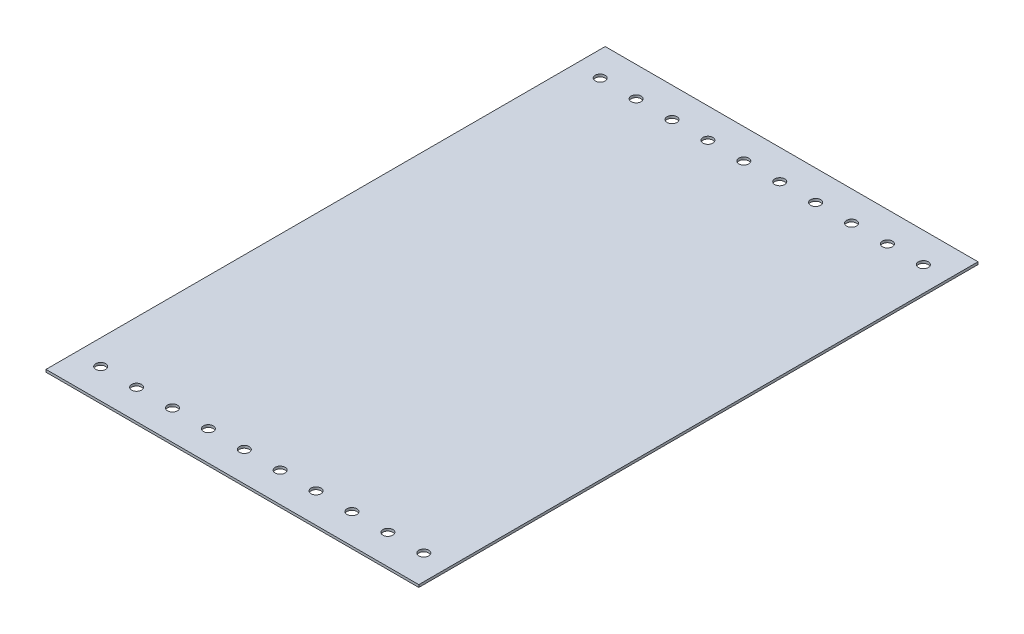
ISO-10303-21;
HEADER;
FILE_DESCRIPTION(('STEP AP214'),'2;1');
FILE_NAME('part.step','',(''),(''),'','','');
FILE_SCHEMA(('AUTOMOTIVE_DESIGN { 1 0 10303 214 1 1 1 1 }'));
ENDSEC;
DATA;
#1=APPLICATION_CONTEXT('core data for automotive mechanical design processes');
#2=APPLICATION_PROTOCOL_DEFINITION('international standard','automotive_design',2000,#1);
#3=PRODUCT_CONTEXT('',#1,'mechanical');
#4=PRODUCT('Part','Part','',(#3));
#5=PRODUCT_RELATED_PRODUCT_CATEGORY('part','',(#4));
#6=PRODUCT_DEFINITION_FORMATION('','',#4);
#7=PRODUCT_DEFINITION_CONTEXT('part definition',#1,'design');
#8=PRODUCT_DEFINITION('design','',#6,#7);
#9=PRODUCT_DEFINITION_SHAPE('','',#8);
#10=(LENGTH_UNIT() NAMED_UNIT(*) SI_UNIT(.MILLI.,.METRE.));
#11=(NAMED_UNIT(*) PLANE_ANGLE_UNIT() SI_UNIT($,.RADIAN.));
#12=(NAMED_UNIT(*) SI_UNIT($,.STERADIAN.) SOLID_ANGLE_UNIT());
#13=UNCERTAINTY_MEASURE_WITH_UNIT(LENGTH_MEASURE(1.E-05),#10,'distance_accuracy_value','');
#14=(GEOMETRIC_REPRESENTATION_CONTEXT(3) GLOBAL_UNCERTAINTY_ASSIGNED_CONTEXT((#13)) GLOBAL_UNIT_ASSIGNED_CONTEXT((#10,
#11,#12)) REPRESENTATION_CONTEXT('',''));
#15=CARTESIAN_POINT('',(0.,0.,0.));
#16=DIRECTION('',(0.,0.,1.));
#17=DIRECTION('',(1.,0.,0.));
#18=AXIS2_PLACEMENT_3D('',#15,#16,#17);
#19=CARTESIAN_POINT('',(-150.,2.,225.));
#20=DIRECTION('',(1.,0.,0.));
#21=DIRECTION('',(0.,0.,-1.));
#22=AXIS2_PLACEMENT_3D('',#19,#20,#21);
#23=PLANE('',#22);
#24=DIRECTION('',(0.,0.,1.));
#25=VECTOR('',#24,1.);
#26=CARTESIAN_POINT('',(-150.,0.,225.));
#27=LINE('',#26,#25);
#28=CARTESIAN_POINT('',(-150.,0.,-225.));
#29=VERTEX_POINT('',#28);
#30=CARTESIAN_POINT('',(-150.,0.,225.));
#31=VERTEX_POINT('',#30);
#32=EDGE_CURVE('E96',#29,#31,#27,.T.);
#33=ORIENTED_EDGE('',*,*,#32,.T.);
#34=DIRECTION('',(0.,-1.,0.));
#35=VECTOR('',#34,1.);
#36=CARTESIAN_POINT('',(-150.,2.,225.));
#37=LINE('',#36,#35);
#38=CARTESIAN_POINT('',(-150.,2.,225.));
#39=VERTEX_POINT('',#38);
#40=EDGE_CURVE('E11',#39,#31,#37,.T.);
#41=ORIENTED_EDGE('',*,*,#40,.F.);
#42=DIRECTION('',(0.,0.,1.));
#43=VECTOR('',#42,1.);
#44=CARTESIAN_POINT('',(-150.,2.,225.));
#45=LINE('',#44,#43);
#46=CARTESIAN_POINT('',(-150.,2.,-225.));
#47=VERTEX_POINT('',#46);
#48=EDGE_CURVE('E84',#47,#39,#45,.T.);
#49=ORIENTED_EDGE('',*,*,#48,.F.);
#50=DIRECTION('',(0.,-1.,0.));
#51=VECTOR('',#50,1.);
#52=CARTESIAN_POINT('',(-150.,2.,-225.));
#53=LINE('',#52,#51);
#54=EDGE_CURVE('E92',#47,#29,#53,.T.);
#55=ORIENTED_EDGE('',*,*,#54,.T.);
#56=EDGE_LOOP('',(#33,#41,#49,#55));
#57=FACE_BOUND('',#56,.T.);
#58=ADVANCED_FACE('F33',(#57),#23,.F.);
#59=CARTESIAN_POINT('',(150.,2.,225.));
#60=DIRECTION('',(0.,0.,-1.));
#61=DIRECTION('',(-1.,0.,0.));
#62=AXIS2_PLACEMENT_3D('',#59,#60,#61);
#63=PLANE('',#62);
#64=DIRECTION('',(1.,0.,0.));
#65=VECTOR('',#64,1.);
#66=CARTESIAN_POINT('',(150.,0.,225.));
#67=LINE('',#66,#65);
#68=CARTESIAN_POINT('',(150.,0.,225.));
#69=VERTEX_POINT('',#68);
#70=EDGE_CURVE('E88',#31,#69,#67,.T.);
#71=ORIENTED_EDGE('',*,*,#70,.T.);
#72=DIRECTION('',(0.,-1.,0.));
#73=VECTOR('',#72,1.);
#74=CARTESIAN_POINT('',(150.,2.,225.));
#75=LINE('',#74,#73);
#76=CARTESIAN_POINT('',(150.,2.,225.));
#77=VERTEX_POINT('',#76);
#78=EDGE_CURVE('E41',#77,#69,#75,.T.);
#79=ORIENTED_EDGE('',*,*,#78,.F.);
#80=DIRECTION('',(1.,0.,0.));
#81=VECTOR('',#80,1.);
#82=CARTESIAN_POINT('',(150.,2.,225.));
#83=LINE('',#82,#81);
#84=EDGE_CURVE('E79',#39,#77,#83,.T.);
#85=ORIENTED_EDGE('',*,*,#84,.F.);
#86=ORIENTED_EDGE('',*,*,#40,.T.);
#87=EDGE_LOOP('',(#71,#79,#85,#86));
#88=FACE_BOUND('',#87,.T.);
#89=ADVANCED_FACE('F87',(#88),#63,.F.);
#90=CARTESIAN_POINT('',(150.,2.,225.));
#91=DIRECTION('',(-1.,0.,0.));
#92=DIRECTION('',(0.,0.,1.));
#93=AXIS2_PLACEMENT_3D('',#90,#91,#92);
#94=PLANE('',#93);
#95=DIRECTION('',(0.,0.,-1.));
#96=VECTOR('',#95,1.);
#97=CARTESIAN_POINT('',(150.,0.,225.));
#98=LINE('',#97,#96);
#99=CARTESIAN_POINT('',(150.,0.,-225.));
#100=VERTEX_POINT('',#99);
#101=EDGE_CURVE('E66',#69,#100,#98,.T.);
#102=ORIENTED_EDGE('',*,*,#101,.T.);
#103=DIRECTION('',(0.,-1.,0.));
#104=VECTOR('',#103,1.);
#105=CARTESIAN_POINT('',(150.,2.,-225.));
#106=LINE('',#105,#104);
#107=CARTESIAN_POINT('',(150.,2.,-225.));
#108=VERTEX_POINT('',#107);
#109=EDGE_CURVE('E89',#108,#100,#106,.T.);
#110=ORIENTED_EDGE('',*,*,#109,.F.);
#111=DIRECTION('',(0.,0.,-1.));
#112=VECTOR('',#111,1.);
#113=CARTESIAN_POINT('',(150.,2.,225.));
#114=LINE('',#113,#112);
#115=EDGE_CURVE('E82',#77,#108,#114,.T.);
#116=ORIENTED_EDGE('',*,*,#115,.F.);
#117=ORIENTED_EDGE('',*,*,#78,.T.);
#118=EDGE_LOOP('',(#102,#110,#116,#117));
#119=FACE_BOUND('',#118,.T.);
#120=ADVANCED_FACE('F90',(#119),#94,.F.);
#121=CARTESIAN_POINT('',(150.,2.,-225.));
#122=DIRECTION('',(0.,0.,1.));
#123=DIRECTION('',(1.,0.,0.));
#124=AXIS2_PLACEMENT_3D('',#121,#122,#123);
#125=PLANE('',#124);
#126=DIRECTION('',(-1.,0.,0.));
#127=VECTOR('',#126,1.);
#128=CARTESIAN_POINT('',(150.,0.,-225.));
#129=LINE('',#128,#127);
#130=EDGE_CURVE('E72',#100,#29,#129,.T.);
#131=ORIENTED_EDGE('',*,*,#130,.T.);
#132=ORIENTED_EDGE('',*,*,#54,.F.);
#133=DIRECTION('',(-1.,0.,0.));
#134=VECTOR('',#133,1.);
#135=CARTESIAN_POINT('',(150.,2.,-225.));
#136=LINE('',#135,#134);
#137=EDGE_CURVE('E49',#108,#47,#136,.T.);
#138=ORIENTED_EDGE('',*,*,#137,.F.);
#139=ORIENTED_EDGE('',*,*,#109,.T.);
#140=EDGE_LOOP('',(#131,#132,#138,#139));
#141=FACE_BOUND('',#140,.T.);
#142=ADVANCED_FACE('F104',(#141),#125,.F.);
#143=CARTESIAN_POINT('',(0.,2.,0.));
#144=DIRECTION('',(0.,1.,0.));
#145=DIRECTION('',(0.,0.,1.));
#146=AXIS2_PLACEMENT_3D('',#143,#144,#145);
#147=PLANE('',#146);
#148=CARTESIAN_POINT('',(-43.3333333333332,2.,201.));
#149=DIRECTION('',(0.,1.,0.));
#150=DIRECTION('',(0.,0.,-1.));
#151=AXIS2_PLACEMENT_3D('',#148,#149,#150);
#152=CIRCLE('',#151,3.99999999999999);
#153=CARTESIAN_POINT('',(-43.3333333333332,2.,197.));
#154=VERTEX_POINT('',#153);
#155=EDGE_CURVE('E164',#154,#154,#152,.T.);
#156=ORIENTED_EDGE('',*,*,#155,.F.);
#157=EDGE_LOOP('',(#156));
#158=FACE_BOUND('',#157,.T.);
#159=CARTESIAN_POINT('',(-14.4444444444444,2.,201.));
#160=DIRECTION('',(0.,1.,0.));
#161=DIRECTION('',(0.,0.,-1.));
#162=AXIS2_PLACEMENT_3D('',#159,#160,#161);
#163=CIRCLE('',#162,3.99999999999999);
#164=CARTESIAN_POINT('',(-14.4444444444444,2.,197.));
#165=VERTEX_POINT('',#164);
#166=EDGE_CURVE('E171',#165,#165,#163,.T.);
#167=ORIENTED_EDGE('',*,*,#166,.F.);
#168=EDGE_LOOP('',(#167));
#169=FACE_BOUND('',#168,.T.);
#170=CARTESIAN_POINT('',(14.4444444444445,2.,201.));
#171=DIRECTION('',(0.,1.,0.));
#172=DIRECTION('',(0.,0.,-1.));
#173=AXIS2_PLACEMENT_3D('',#170,#171,#172);
#174=CIRCLE('',#173,3.99999999999999);
#175=CARTESIAN_POINT('',(14.4444444444445,2.,197.));
#176=VERTEX_POINT('',#175);
#177=EDGE_CURVE('E177',#176,#176,#174,.T.);
#178=ORIENTED_EDGE('',*,*,#177,.F.);
#179=EDGE_LOOP('',(#178));
#180=FACE_BOUND('',#179,.T.);
#181=CARTESIAN_POINT('',(43.3333333333334,2.,201.));
#182=DIRECTION('',(0.,1.,0.));
#183=DIRECTION('',(0.,0.,-1.));
#184=AXIS2_PLACEMENT_3D('',#181,#182,#183);
#185=CIRCLE('',#184,3.99999999999999);
#186=CARTESIAN_POINT('',(43.3333333333334,2.,197.));
#187=VERTEX_POINT('',#186);
#188=EDGE_CURVE('E183',#187,#187,#185,.T.);
#189=ORIENTED_EDGE('',*,*,#188,.F.);
#190=EDGE_LOOP('',(#189));
#191=FACE_BOUND('',#190,.T.);
#192=CARTESIAN_POINT('',(72.2222222222223,2.,201.));
#193=DIRECTION('',(0.,1.,0.));
#194=DIRECTION('',(0.,0.,-1.));
#195=AXIS2_PLACEMENT_3D('',#192,#193,#194);
#196=CIRCLE('',#195,3.99999999999998);
#197=CARTESIAN_POINT('',(72.2222222222223,2.,197.));
#198=VERTEX_POINT('',#197);
#199=EDGE_CURVE('E189',#198,#198,#196,.T.);
#200=ORIENTED_EDGE('',*,*,#199,.F.);
#201=EDGE_LOOP('',(#200));
#202=FACE_BOUND('',#201,.T.);
#203=CARTESIAN_POINT('',(101.111111111111,2.,201.));
#204=DIRECTION('',(0.,1.,0.));
#205=DIRECTION('',(0.,0.,-1.));
#206=AXIS2_PLACEMENT_3D('',#203,#204,#205);
#207=CIRCLE('',#206,3.99999999999999);
#208=CARTESIAN_POINT('',(101.111111111111,2.,197.));
#209=VERTEX_POINT('',#208);
#210=EDGE_CURVE('E195',#209,#209,#207,.T.);
#211=ORIENTED_EDGE('',*,*,#210,.F.);
#212=EDGE_LOOP('',(#211));
#213=FACE_BOUND('',#212,.T.);
#214=CARTESIAN_POINT('',(130.,2.,201.));
#215=DIRECTION('',(0.,1.,0.));
#216=DIRECTION('',(0.,0.,-1.));
#217=AXIS2_PLACEMENT_3D('',#214,#215,#216);
#218=CIRCLE('',#217,3.99999999999999);
#219=CARTESIAN_POINT('',(130.,2.,197.));
#220=VERTEX_POINT('',#219);
#221=EDGE_CURVE('E201',#220,#220,#218,.T.);
#222=ORIENTED_EDGE('',*,*,#221,.F.);
#223=EDGE_LOOP('',(#222));
#224=FACE_BOUND('',#223,.T.);
#225=CARTESIAN_POINT('',(130.,2.,-201.));
#226=DIRECTION('',(0.,1.,0.));
#227=DIRECTION('',(0.,0.,1.));
#228=AXIS2_PLACEMENT_3D('',#225,#226,#227);
#229=CIRCLE('',#228,3.99999999999999);
#230=CARTESIAN_POINT('',(130.,2.,-197.));
#231=VERTEX_POINT('',#230);
#232=EDGE_CURVE('E207',#231,#231,#229,.T.);
#233=ORIENTED_EDGE('',*,*,#232,.F.);
#234=EDGE_LOOP('',(#233));
#235=FACE_BOUND('',#234,.T.);
#236=CARTESIAN_POINT('',(101.111111111111,2.,-201.));
#237=DIRECTION('',(0.,1.,0.));
#238=DIRECTION('',(0.,0.,1.));
#239=AXIS2_PLACEMENT_3D('',#236,#237,#238);
#240=CIRCLE('',#239,3.99999999999999);
#241=CARTESIAN_POINT('',(101.111111111111,2.,-197.));
#242=VERTEX_POINT('',#241);
#243=EDGE_CURVE('E116',#242,#242,#240,.T.);
#244=ORIENTED_EDGE('',*,*,#243,.F.);
#245=EDGE_LOOP('',(#244));
#246=FACE_BOUND('',#245,.T.);
#247=CARTESIAN_POINT('',(72.2222222222222,2.,-201.));
#248=DIRECTION('',(0.,1.,0.));
#249=DIRECTION('',(0.,0.,1.));
#250=AXIS2_PLACEMENT_3D('',#247,#248,#249);
#251=CIRCLE('',#250,3.99999999999999);
#252=CARTESIAN_POINT('',(72.2222222222222,2.,-197.));
#253=VERTEX_POINT('',#252);
#254=EDGE_CURVE('E123',#253,#253,#251,.T.);
#255=ORIENTED_EDGE('',*,*,#254,.F.);
#256=EDGE_LOOP('',(#255));
#257=FACE_BOUND('',#256,.T.);
#258=CARTESIAN_POINT('',(43.3333333333333,2.,-201.));
#259=DIRECTION('',(0.,1.,0.));
#260=DIRECTION('',(0.,0.,1.));
#261=AXIS2_PLACEMENT_3D('',#258,#259,#260);
#262=CIRCLE('',#261,3.99999999999999);
#263=CARTESIAN_POINT('',(43.3333333333333,2.,-197.));
#264=VERTEX_POINT('',#263);
#265=EDGE_CURVE('E129',#264,#264,#262,.T.);
#266=ORIENTED_EDGE('',*,*,#265,.F.);
#267=EDGE_LOOP('',(#266));
#268=FACE_BOUND('',#267,.T.);
#269=CARTESIAN_POINT('',(14.4444444444445,2.,-201.));
#270=DIRECTION('',(0.,1.,0.));
#271=DIRECTION('',(0.,0.,1.));
#272=AXIS2_PLACEMENT_3D('',#269,#270,#271);
#273=CIRCLE('',#272,3.99999999999999);
#274=CARTESIAN_POINT('',(14.4444444444445,2.,-197.));
#275=VERTEX_POINT('',#274);
#276=EDGE_CURVE('E135',#275,#275,#273,.T.);
#277=ORIENTED_EDGE('',*,*,#276,.F.);
#278=EDGE_LOOP('',(#277));
#279=FACE_BOUND('',#278,.T.);
#280=CARTESIAN_POINT('',(-14.4444444444444,2.,-201.));
#281=DIRECTION('',(0.,1.,0.));
#282=DIRECTION('',(0.,0.,1.));
#283=AXIS2_PLACEMENT_3D('',#280,#281,#282);
#284=CIRCLE('',#283,3.99999999999999);
#285=CARTESIAN_POINT('',(-14.4444444444444,2.,-197.));
#286=VERTEX_POINT('',#285);
#287=EDGE_CURVE('E141',#286,#286,#284,.T.);
#288=ORIENTED_EDGE('',*,*,#287,.F.);
#289=EDGE_LOOP('',(#288));
#290=FACE_BOUND('',#289,.T.);
#291=CARTESIAN_POINT('',(-43.3333333333333,2.,-201.));
#292=DIRECTION('',(0.,1.,0.));
#293=DIRECTION('',(0.,0.,1.));
#294=AXIS2_PLACEMENT_3D('',#291,#292,#293);
#295=CIRCLE('',#294,3.99999999999999);
#296=CARTESIAN_POINT('',(-43.3333333333333,2.,-197.));
#297=VERTEX_POINT('',#296);
#298=EDGE_CURVE('E147',#297,#297,#295,.T.);
#299=ORIENTED_EDGE('',*,*,#298,.F.);
#300=EDGE_LOOP('',(#299));
#301=FACE_BOUND('',#300,.T.);
#302=CARTESIAN_POINT('',(-72.2222222222222,2.,-201.));
#303=DIRECTION('',(0.,1.,0.));
#304=DIRECTION('',(0.,0.,1.));
#305=AXIS2_PLACEMENT_3D('',#302,#303,#304);
#306=CIRCLE('',#305,3.99999999999999);
#307=CARTESIAN_POINT('',(-72.2222222222222,2.,-197.));
#308=VERTEX_POINT('',#307);
#309=EDGE_CURVE('E153',#308,#308,#306,.T.);
#310=ORIENTED_EDGE('',*,*,#309,.F.);
#311=EDGE_LOOP('',(#310));
#312=FACE_BOUND('',#311,.T.);
#313=CARTESIAN_POINT('',(-101.111111111111,2.,-201.));
#314=DIRECTION('',(0.,1.,0.));
#315=DIRECTION('',(0.,0.,1.));
#316=AXIS2_PLACEMENT_3D('',#313,#314,#315);
#317=CIRCLE('',#316,3.99999999999999);
#318=CARTESIAN_POINT('',(-101.111111111111,2.,-197.));
#319=VERTEX_POINT('',#318);
#320=EDGE_CURVE('E159',#319,#319,#317,.T.);
#321=ORIENTED_EDGE('',*,*,#320,.F.);
#322=EDGE_LOOP('',(#321));
#323=FACE_BOUND('',#322,.T.);
#324=CARTESIAN_POINT('',(-72.2222222222221,2.,201.));
#325=DIRECTION('',(0.,1.,0.));
#326=DIRECTION('',(0.,0.,-1.));
#327=AXIS2_PLACEMENT_3D('',#324,#325,#326);
#328=CIRCLE('',#327,3.99999999999999);
#329=CARTESIAN_POINT('',(-72.2222222222221,2.,197.));
#330=VERTEX_POINT('',#329);
#331=EDGE_CURVE('E224',#330,#330,#328,.T.);
#332=ORIENTED_EDGE('',*,*,#331,.F.);
#333=EDGE_LOOP('',(#332));
#334=FACE_BOUND('',#333,.T.);
#335=CARTESIAN_POINT('',(-101.111111111111,2.,201.));
#336=DIRECTION('',(0.,1.,0.));
#337=DIRECTION('',(0.,0.,-1.));
#338=AXIS2_PLACEMENT_3D('',#335,#336,#337);
#339=CIRCLE('',#338,3.99999999999999);
#340=CARTESIAN_POINT('',(-101.111111111111,2.,197.));
#341=VERTEX_POINT('',#340);
#342=EDGE_CURVE('E218',#341,#341,#339,.T.);
#343=ORIENTED_EDGE('',*,*,#342,.F.);
#344=EDGE_LOOP('',(#343));
#345=FACE_BOUND('',#344,.T.);
#346=CARTESIAN_POINT('',(-130.,2.,201.));
#347=DIRECTION('',(0.,1.,0.));
#348=DIRECTION('',(0.,0.,-1.));
#349=AXIS2_PLACEMENT_3D('',#346,#347,#348);
#350=CIRCLE('',#349,3.99999999999999);
#351=CARTESIAN_POINT('',(-130.,2.,197.));
#352=VERTEX_POINT('',#351);
#353=EDGE_CURVE('E212',#352,#352,#350,.T.);
#354=ORIENTED_EDGE('',*,*,#353,.F.);
#355=EDGE_LOOP('',(#354));
#356=FACE_BOUND('',#355,.T.);
#357=CARTESIAN_POINT('',(-130.,2.,-201.));
#358=DIRECTION('',(0.,1.,0.));
#359=DIRECTION('',(0.,0.,1.));
#360=AXIS2_PLACEMENT_3D('',#357,#358,#359);
#361=CIRCLE('',#360,3.99999999999999);
#362=CARTESIAN_POINT('',(-130.,2.,-197.));
#363=VERTEX_POINT('',#362);
#364=EDGE_CURVE('E110',#363,#363,#361,.T.);
#365=ORIENTED_EDGE('',*,*,#364,.F.);
#366=EDGE_LOOP('',(#365));
#367=FACE_BOUND('',#366,.T.);
#368=ORIENTED_EDGE('',*,*,#48,.T.);
#369=ORIENTED_EDGE('',*,*,#84,.T.);
#370=ORIENTED_EDGE('',*,*,#115,.T.);
#371=ORIENTED_EDGE('',*,*,#137,.T.);
#372=EDGE_LOOP('',(#368,#369,#370,#371));
#373=FACE_BOUND('',#372,.T.);
#374=ADVANCED_FACE('F80',(#158,#169,#180,#191,#202,#213,#224,#235,#246,#257,#268,#279,#290,#301,
#312,#323,#334,#345,#356,#367,#373),#147,.T.);
#375=CARTESIAN_POINT('',(0.,0.,0.));
#376=DIRECTION('',(0.,1.,0.));
#377=DIRECTION('',(0.,0.,1.));
#378=AXIS2_PLACEMENT_3D('',#375,#376,#377);
#379=PLANE('',#378);
#380=CARTESIAN_POINT('',(-43.3333333333332,0.,201.));
#381=DIRECTION('',(0.,1.,0.));
#382=DIRECTION('',(0.,0.,-1.));
#383=AXIS2_PLACEMENT_3D('',#380,#381,#382);
#384=CIRCLE('',#383,3.99999999999999);
#385=CARTESIAN_POINT('',(-43.3333333333332,0.,197.));
#386=VERTEX_POINT('',#385);
#387=EDGE_CURVE('E167',#386,#386,#384,.T.);
#388=ORIENTED_EDGE('',*,*,#387,.T.);
#389=EDGE_LOOP('',(#388));
#390=FACE_BOUND('',#389,.T.);
#391=CARTESIAN_POINT('',(-14.4444444444444,0.,201.));
#392=DIRECTION('',(0.,1.,0.));
#393=DIRECTION('',(0.,0.,-1.));
#394=AXIS2_PLACEMENT_3D('',#391,#392,#393);
#395=CIRCLE('',#394,3.99999999999999);
#396=CARTESIAN_POINT('',(-14.4444444444444,0.,197.));
#397=VERTEX_POINT('',#396);
#398=EDGE_CURVE('E174',#397,#397,#395,.T.);
#399=ORIENTED_EDGE('',*,*,#398,.T.);
#400=EDGE_LOOP('',(#399));
#401=FACE_BOUND('',#400,.T.);
#402=CARTESIAN_POINT('',(14.4444444444445,0.,201.));
#403=DIRECTION('',(0.,1.,0.));
#404=DIRECTION('',(0.,0.,-1.));
#405=AXIS2_PLACEMENT_3D('',#402,#403,#404);
#406=CIRCLE('',#405,3.99999999999999);
#407=CARTESIAN_POINT('',(14.4444444444445,0.,197.));
#408=VERTEX_POINT('',#407);
#409=EDGE_CURVE('E180',#408,#408,#406,.T.);
#410=ORIENTED_EDGE('',*,*,#409,.T.);
#411=EDGE_LOOP('',(#410));
#412=FACE_BOUND('',#411,.T.);
#413=CARTESIAN_POINT('',(43.3333333333334,0.,201.));
#414=DIRECTION('',(0.,1.,0.));
#415=DIRECTION('',(0.,0.,-1.));
#416=AXIS2_PLACEMENT_3D('',#413,#414,#415);
#417=CIRCLE('',#416,3.99999999999999);
#418=CARTESIAN_POINT('',(43.3333333333334,0.,197.));
#419=VERTEX_POINT('',#418);
#420=EDGE_CURVE('E186',#419,#419,#417,.T.);
#421=ORIENTED_EDGE('',*,*,#420,.T.);
#422=EDGE_LOOP('',(#421));
#423=FACE_BOUND('',#422,.T.);
#424=CARTESIAN_POINT('',(72.2222222222223,0.,201.));
#425=DIRECTION('',(0.,1.,0.));
#426=DIRECTION('',(0.,0.,-1.));
#427=AXIS2_PLACEMENT_3D('',#424,#425,#426);
#428=CIRCLE('',#427,3.99999999999998);
#429=CARTESIAN_POINT('',(72.2222222222223,0.,197.));
#430=VERTEX_POINT('',#429);
#431=EDGE_CURVE('E192',#430,#430,#428,.T.);
#432=ORIENTED_EDGE('',*,*,#431,.T.);
#433=EDGE_LOOP('',(#432));
#434=FACE_BOUND('',#433,.T.);
#435=CARTESIAN_POINT('',(101.111111111111,0.,201.));
#436=DIRECTION('',(0.,1.,0.));
#437=DIRECTION('',(0.,0.,-1.));
#438=AXIS2_PLACEMENT_3D('',#435,#436,#437);
#439=CIRCLE('',#438,3.99999999999999);
#440=CARTESIAN_POINT('',(101.111111111111,0.,197.));
#441=VERTEX_POINT('',#440);
#442=EDGE_CURVE('E198',#441,#441,#439,.T.);
#443=ORIENTED_EDGE('',*,*,#442,.T.);
#444=EDGE_LOOP('',(#443));
#445=FACE_BOUND('',#444,.T.);
#446=CARTESIAN_POINT('',(130.,0.,201.));
#447=DIRECTION('',(0.,1.,0.));
#448=DIRECTION('',(0.,0.,-1.));
#449=AXIS2_PLACEMENT_3D('',#446,#447,#448);
#450=CIRCLE('',#449,3.99999999999999);
#451=CARTESIAN_POINT('',(130.,0.,197.));
#452=VERTEX_POINT('',#451);
#453=EDGE_CURVE('E204',#452,#452,#450,.T.);
#454=ORIENTED_EDGE('',*,*,#453,.T.);
#455=EDGE_LOOP('',(#454));
#456=FACE_BOUND('',#455,.T.);
#457=CARTESIAN_POINT('',(130.,0.,-201.));
#458=DIRECTION('',(0.,1.,0.));
#459=DIRECTION('',(0.,0.,1.));
#460=AXIS2_PLACEMENT_3D('',#457,#458,#459);
#461=CIRCLE('',#460,3.99999999999999);
#462=CARTESIAN_POINT('',(130.,0.,-197.));
#463=VERTEX_POINT('',#462);
#464=EDGE_CURVE('E120',#463,#463,#461,.T.);
#465=ORIENTED_EDGE('',*,*,#464,.T.);
#466=EDGE_LOOP('',(#465));
#467=FACE_BOUND('',#466,.T.);
#468=CARTESIAN_POINT('',(101.111111111111,0.,-201.));
#469=DIRECTION('',(0.,1.,0.));
#470=DIRECTION('',(0.,0.,1.));
#471=AXIS2_PLACEMENT_3D('',#468,#469,#470);
#472=CIRCLE('',#471,3.99999999999999);
#473=CARTESIAN_POINT('',(101.111111111111,0.,-197.));
#474=VERTEX_POINT('',#473);
#475=EDGE_CURVE('E119',#474,#474,#472,.T.);
#476=ORIENTED_EDGE('',*,*,#475,.T.);
#477=EDGE_LOOP('',(#476));
#478=FACE_BOUND('',#477,.T.);
#479=CARTESIAN_POINT('',(72.2222222222222,0.,-201.));
#480=DIRECTION('',(0.,1.,0.));
#481=DIRECTION('',(0.,0.,1.));
#482=AXIS2_PLACEMENT_3D('',#479,#480,#481);
#483=CIRCLE('',#482,3.99999999999999);
#484=CARTESIAN_POINT('',(72.2222222222222,0.,-197.));
#485=VERTEX_POINT('',#484);
#486=EDGE_CURVE('E126',#485,#485,#483,.T.);
#487=ORIENTED_EDGE('',*,*,#486,.T.);
#488=EDGE_LOOP('',(#487));
#489=FACE_BOUND('',#488,.T.);
#490=CARTESIAN_POINT('',(43.3333333333333,0.,-201.));
#491=DIRECTION('',(0.,1.,0.));
#492=DIRECTION('',(0.,0.,1.));
#493=AXIS2_PLACEMENT_3D('',#490,#491,#492);
#494=CIRCLE('',#493,3.99999999999999);
#495=CARTESIAN_POINT('',(43.3333333333333,0.,-197.));
#496=VERTEX_POINT('',#495);
#497=EDGE_CURVE('E132',#496,#496,#494,.T.);
#498=ORIENTED_EDGE('',*,*,#497,.T.);
#499=EDGE_LOOP('',(#498));
#500=FACE_BOUND('',#499,.T.);
#501=CARTESIAN_POINT('',(14.4444444444445,0.,-201.));
#502=DIRECTION('',(0.,1.,0.));
#503=DIRECTION('',(0.,0.,1.));
#504=AXIS2_PLACEMENT_3D('',#501,#502,#503);
#505=CIRCLE('',#504,3.99999999999999);
#506=CARTESIAN_POINT('',(14.4444444444445,0.,-197.));
#507=VERTEX_POINT('',#506);
#508=EDGE_CURVE('E138',#507,#507,#505,.T.);
#509=ORIENTED_EDGE('',*,*,#508,.T.);
#510=EDGE_LOOP('',(#509));
#511=FACE_BOUND('',#510,.T.);
#512=CARTESIAN_POINT('',(-14.4444444444444,0.,-201.));
#513=DIRECTION('',(0.,1.,0.));
#514=DIRECTION('',(0.,0.,1.));
#515=AXIS2_PLACEMENT_3D('',#512,#513,#514);
#516=CIRCLE('',#515,3.99999999999999);
#517=CARTESIAN_POINT('',(-14.4444444444444,0.,-197.));
#518=VERTEX_POINT('',#517);
#519=EDGE_CURVE('E144',#518,#518,#516,.T.);
#520=ORIENTED_EDGE('',*,*,#519,.T.);
#521=EDGE_LOOP('',(#520));
#522=FACE_BOUND('',#521,.T.);
#523=CARTESIAN_POINT('',(-43.3333333333333,0.,-201.));
#524=DIRECTION('',(0.,1.,0.));
#525=DIRECTION('',(0.,0.,1.));
#526=AXIS2_PLACEMENT_3D('',#523,#524,#525);
#527=CIRCLE('',#526,3.99999999999999);
#528=CARTESIAN_POINT('',(-43.3333333333333,0.,-197.));
#529=VERTEX_POINT('',#528);
#530=EDGE_CURVE('E150',#529,#529,#527,.T.);
#531=ORIENTED_EDGE('',*,*,#530,.T.);
#532=EDGE_LOOP('',(#531));
#533=FACE_BOUND('',#532,.T.);
#534=CARTESIAN_POINT('',(-72.2222222222222,0.,-201.));
#535=DIRECTION('',(0.,1.,0.));
#536=DIRECTION('',(0.,0.,1.));
#537=AXIS2_PLACEMENT_3D('',#534,#535,#536);
#538=CIRCLE('',#537,3.99999999999999);
#539=CARTESIAN_POINT('',(-72.2222222222222,0.,-197.));
#540=VERTEX_POINT('',#539);
#541=EDGE_CURVE('E156',#540,#540,#538,.T.);
#542=ORIENTED_EDGE('',*,*,#541,.T.);
#543=EDGE_LOOP('',(#542));
#544=FACE_BOUND('',#543,.T.);
#545=CARTESIAN_POINT('',(-101.111111111111,0.,-201.));
#546=DIRECTION('',(0.,1.,0.));
#547=DIRECTION('',(0.,0.,1.));
#548=AXIS2_PLACEMENT_3D('',#545,#546,#547);
#549=CIRCLE('',#548,3.99999999999999);
#550=CARTESIAN_POINT('',(-101.111111111111,0.,-197.));
#551=VERTEX_POINT('',#550);
#552=EDGE_CURVE('E113',#551,#551,#549,.T.);
#553=ORIENTED_EDGE('',*,*,#552,.T.);
#554=EDGE_LOOP('',(#553));
#555=FACE_BOUND('',#554,.T.);
#556=CARTESIAN_POINT('',(-72.2222222222221,0.,201.));
#557=DIRECTION('',(0.,1.,0.));
#558=DIRECTION('',(0.,0.,-1.));
#559=AXIS2_PLACEMENT_3D('',#556,#557,#558);
#560=CIRCLE('',#559,3.99999999999999);
#561=CARTESIAN_POINT('',(-72.2222222222221,0.,197.));
#562=VERTEX_POINT('',#561);
#563=EDGE_CURVE('E168',#562,#562,#560,.T.);
#564=ORIENTED_EDGE('',*,*,#563,.T.);
#565=EDGE_LOOP('',(#564));
#566=FACE_BOUND('',#565,.T.);
#567=CARTESIAN_POINT('',(-101.111111111111,0.,201.));
#568=DIRECTION('',(0.,1.,0.));
#569=DIRECTION('',(0.,0.,-1.));
#570=AXIS2_PLACEMENT_3D('',#567,#568,#569);
#571=CIRCLE('',#570,3.99999999999999);
#572=CARTESIAN_POINT('',(-101.111111111111,0.,197.));
#573=VERTEX_POINT('',#572);
#574=EDGE_CURVE('E221',#573,#573,#571,.T.);
#575=ORIENTED_EDGE('',*,*,#574,.T.);
#576=EDGE_LOOP('',(#575));
#577=FACE_BOUND('',#576,.T.);
#578=CARTESIAN_POINT('',(-130.,0.,201.));
#579=DIRECTION('',(0.,1.,0.));
#580=DIRECTION('',(0.,0.,-1.));
#581=AXIS2_PLACEMENT_3D('',#578,#579,#580);
#582=CIRCLE('',#581,3.99999999999999);
#583=CARTESIAN_POINT('',(-130.,0.,197.));
#584=VERTEX_POINT('',#583);
#585=EDGE_CURVE('E215',#584,#584,#582,.T.);
#586=ORIENTED_EDGE('',*,*,#585,.T.);
#587=EDGE_LOOP('',(#586));
#588=FACE_BOUND('',#587,.T.);
#589=CARTESIAN_POINT('',(-130.,0.,-201.));
#590=DIRECTION('',(0.,1.,0.));
#591=DIRECTION('',(0.,0.,1.));
#592=AXIS2_PLACEMENT_3D('',#589,#590,#591);
#593=CIRCLE('',#592,3.99999999999999);
#594=CARTESIAN_POINT('',(-130.,0.,-197.));
#595=VERTEX_POINT('',#594);
#596=EDGE_CURVE('E99',#595,#595,#593,.T.);
#597=ORIENTED_EDGE('',*,*,#596,.T.);
#598=EDGE_LOOP('',(#597));
#599=FACE_BOUND('',#598,.T.);
#600=ORIENTED_EDGE('',*,*,#32,.F.);
#601=ORIENTED_EDGE('',*,*,#130,.F.);
#602=ORIENTED_EDGE('',*,*,#101,.F.);
#603=ORIENTED_EDGE('',*,*,#70,.F.);
#604=EDGE_LOOP('',(#600,#601,#602,#603));
#605=FACE_BOUND('',#604,.T.);
#606=ADVANCED_FACE('F107',(#390,#401,#412,#423,#434,#445,#456,#467,#478,#489,#500,#511,#522,
#533,#544,#555,#566,#577,#588,#599,#605),#379,.F.);
#607=CARTESIAN_POINT('',(-130.,0.,-201.));
#608=DIRECTION('',(0.,1.,0.));
#609=DIRECTION('',(0.,0.,1.));
#610=AXIS2_PLACEMENT_3D('',#607,#608,#609);
#611=CYLINDRICAL_SURFACE('',#610,3.99999999999999);
#612=ORIENTED_EDGE('',*,*,#596,.F.);
#613=EDGE_LOOP('',(#612));
#614=FACE_BOUND('',#613,.T.);
#615=ORIENTED_EDGE('',*,*,#364,.T.);
#616=EDGE_LOOP('',(#615));
#617=FACE_BOUND('',#616,.T.);
#618=ADVANCED_FACE('F250',(#614,#617),#611,.F.);
#619=CARTESIAN_POINT('',(-130.,0.,201.));
#620=DIRECTION('',(0.,1.,0.));
#621=DIRECTION('',(0.,0.,1.));
#622=AXIS2_PLACEMENT_3D('',#619,#620,#621);
#623=CYLINDRICAL_SURFACE('',#622,3.99999999999999);
#624=ORIENTED_EDGE('',*,*,#585,.F.);
#625=EDGE_LOOP('',(#624));
#626=FACE_BOUND('',#625,.T.);
#627=ORIENTED_EDGE('',*,*,#353,.T.);
#628=EDGE_LOOP('',(#627));
#629=FACE_BOUND('',#628,.T.);
#630=ADVANCED_FACE('F252',(#626,#629),#623,.F.);
#631=CARTESIAN_POINT('',(-101.111111111111,0.,201.));
#632=DIRECTION('',(0.,1.,0.));
#633=DIRECTION('',(0.,0.,1.));
#634=AXIS2_PLACEMENT_3D('',#631,#632,#633);
#635=CYLINDRICAL_SURFACE('',#634,3.99999999999999);
#636=ORIENTED_EDGE('',*,*,#574,.F.);
#637=EDGE_LOOP('',(#636));
#638=FACE_BOUND('',#637,.T.);
#639=ORIENTED_EDGE('',*,*,#342,.T.);
#640=EDGE_LOOP('',(#639));
#641=FACE_BOUND('',#640,.T.);
#642=ADVANCED_FACE('F236',(#638,#641),#635,.F.);
#643=CARTESIAN_POINT('',(-72.2222222222221,0.,201.));
#644=DIRECTION('',(0.,1.,0.));
#645=DIRECTION('',(0.,0.,1.));
#646=AXIS2_PLACEMENT_3D('',#643,#644,#645);
#647=CYLINDRICAL_SURFACE('',#646,3.99999999999999);
#648=ORIENTED_EDGE('',*,*,#563,.F.);
#649=EDGE_LOOP('',(#648));
#650=FACE_BOUND('',#649,.T.);
#651=ORIENTED_EDGE('',*,*,#331,.T.);
#652=EDGE_LOOP('',(#651));
#653=FACE_BOUND('',#652,.T.);
#654=ADVANCED_FACE('F232',(#650,#653),#647,.F.);
#655=CARTESIAN_POINT('',(-101.111111111111,0.,-201.));
#656=DIRECTION('',(0.,1.,0.));
#657=DIRECTION('',(0.,0.,1.));
#658=AXIS2_PLACEMENT_3D('',#655,#656,#657);
#659=CYLINDRICAL_SURFACE('',#658,3.99999999999999);
#660=ORIENTED_EDGE('',*,*,#552,.F.);
#661=EDGE_LOOP('',(#660));
#662=FACE_BOUND('',#661,.T.);
#663=ORIENTED_EDGE('',*,*,#320,.T.);
#664=EDGE_LOOP('',(#663));
#665=FACE_BOUND('',#664,.T.);
#666=ADVANCED_FACE('F235',(#662,#665),#659,.F.);
#667=CARTESIAN_POINT('',(-72.2222222222222,0.,-201.));
#668=DIRECTION('',(0.,1.,0.));
#669=DIRECTION('',(0.,0.,1.));
#670=AXIS2_PLACEMENT_3D('',#667,#668,#669);
#671=CYLINDRICAL_SURFACE('',#670,3.99999999999999);
#672=ORIENTED_EDGE('',*,*,#541,.F.);
#673=EDGE_LOOP('',(#672));
#674=FACE_BOUND('',#673,.T.);
#675=ORIENTED_EDGE('',*,*,#309,.T.);
#676=EDGE_LOOP('',(#675));
#677=FACE_BOUND('',#676,.T.);
#678=ADVANCED_FACE('F321',(#674,#677),#671,.F.);
#679=CARTESIAN_POINT('',(-43.3333333333333,0.,-201.));
#680=DIRECTION('',(0.,1.,0.));
#681=DIRECTION('',(0.,0.,1.));
#682=AXIS2_PLACEMENT_3D('',#679,#680,#681);
#683=CYLINDRICAL_SURFACE('',#682,3.99999999999999);
#684=ORIENTED_EDGE('',*,*,#530,.F.);
#685=EDGE_LOOP('',(#684));
#686=FACE_BOUND('',#685,.T.);
#687=ORIENTED_EDGE('',*,*,#298,.T.);
#688=EDGE_LOOP('',(#687));
#689=FACE_BOUND('',#688,.T.);
#690=ADVANCED_FACE('F331',(#686,#689),#683,.F.);
#691=CARTESIAN_POINT('',(-14.4444444444444,0.,-201.));
#692=DIRECTION('',(0.,1.,0.));
#693=DIRECTION('',(0.,0.,1.));
#694=AXIS2_PLACEMENT_3D('',#691,#692,#693);
#695=CYLINDRICAL_SURFACE('',#694,3.99999999999999);
#696=ORIENTED_EDGE('',*,*,#519,.F.);
#697=EDGE_LOOP('',(#696));
#698=FACE_BOUND('',#697,.T.);
#699=ORIENTED_EDGE('',*,*,#287,.T.);
#700=EDGE_LOOP('',(#699));
#701=FACE_BOUND('',#700,.T.);
#702=ADVANCED_FACE('F341',(#698,#701),#695,.F.);
#703=CARTESIAN_POINT('',(14.4444444444445,0.,-201.));
#704=DIRECTION('',(0.,1.,0.));
#705=DIRECTION('',(0.,0.,1.));
#706=AXIS2_PLACEMENT_3D('',#703,#704,#705);
#707=CYLINDRICAL_SURFACE('',#706,3.99999999999999);
#708=ORIENTED_EDGE('',*,*,#508,.F.);
#709=EDGE_LOOP('',(#708));
#710=FACE_BOUND('',#709,.T.);
#711=ORIENTED_EDGE('',*,*,#276,.T.);
#712=EDGE_LOOP('',(#711));
#713=FACE_BOUND('',#712,.T.);
#714=ADVANCED_FACE('F351',(#710,#713),#707,.F.);
#715=CARTESIAN_POINT('',(43.3333333333333,0.,-201.));
#716=DIRECTION('',(0.,1.,0.));
#717=DIRECTION('',(0.,0.,1.));
#718=AXIS2_PLACEMENT_3D('',#715,#716,#717);
#719=CYLINDRICAL_SURFACE('',#718,3.99999999999999);
#720=ORIENTED_EDGE('',*,*,#497,.F.);
#721=EDGE_LOOP('',(#720));
#722=FACE_BOUND('',#721,.T.);
#723=ORIENTED_EDGE('',*,*,#265,.T.);
#724=EDGE_LOOP('',(#723));
#725=FACE_BOUND('',#724,.T.);
#726=ADVANCED_FACE('F361',(#722,#725),#719,.F.);
#727=CARTESIAN_POINT('',(72.2222222222222,0.,-201.));
#728=DIRECTION('',(0.,1.,0.));
#729=DIRECTION('',(0.,0.,1.));
#730=AXIS2_PLACEMENT_3D('',#727,#728,#729);
#731=CYLINDRICAL_SURFACE('',#730,3.99999999999999);
#732=ORIENTED_EDGE('',*,*,#486,.F.);
#733=EDGE_LOOP('',(#732));
#734=FACE_BOUND('',#733,.T.);
#735=ORIENTED_EDGE('',*,*,#254,.T.);
#736=EDGE_LOOP('',(#735));
#737=FACE_BOUND('',#736,.T.);
#738=ADVANCED_FACE('F371',(#734,#737),#731,.F.);
#739=CARTESIAN_POINT('',(101.111111111111,0.,-201.));
#740=DIRECTION('',(0.,1.,0.));
#741=DIRECTION('',(0.,0.,1.));
#742=AXIS2_PLACEMENT_3D('',#739,#740,#741);
#743=CYLINDRICAL_SURFACE('',#742,3.99999999999999);
#744=ORIENTED_EDGE('',*,*,#475,.F.);
#745=EDGE_LOOP('',(#744));
#746=FACE_BOUND('',#745,.T.);
#747=ORIENTED_EDGE('',*,*,#243,.T.);
#748=EDGE_LOOP('',(#747));
#749=FACE_BOUND('',#748,.T.);
#750=ADVANCED_FACE('F381',(#746,#749),#743,.F.);
#751=CARTESIAN_POINT('',(130.,0.,-201.));
#752=DIRECTION('',(0.,1.,0.));
#753=DIRECTION('',(0.,0.,1.));
#754=AXIS2_PLACEMENT_3D('',#751,#752,#753);
#755=CYLINDRICAL_SURFACE('',#754,3.99999999999999);
#756=ORIENTED_EDGE('',*,*,#464,.F.);
#757=EDGE_LOOP('',(#756));
#758=FACE_BOUND('',#757,.T.);
#759=ORIENTED_EDGE('',*,*,#232,.T.);
#760=EDGE_LOOP('',(#759));
#761=FACE_BOUND('',#760,.T.);
#762=ADVANCED_FACE('F391',(#758,#761),#755,.F.);
#763=CARTESIAN_POINT('',(130.,0.,201.));
#764=DIRECTION('',(0.,1.,0.));
#765=DIRECTION('',(0.,0.,1.));
#766=AXIS2_PLACEMENT_3D('',#763,#764,#765);
#767=CYLINDRICAL_SURFACE('',#766,3.99999999999999);
#768=ORIENTED_EDGE('',*,*,#453,.F.);
#769=EDGE_LOOP('',(#768));
#770=FACE_BOUND('',#769,.T.);
#771=ORIENTED_EDGE('',*,*,#221,.T.);
#772=EDGE_LOOP('',(#771));
#773=FACE_BOUND('',#772,.T.);
#774=ADVANCED_FACE('F400',(#770,#773),#767,.F.);
#775=CARTESIAN_POINT('',(101.111111111111,0.,201.));
#776=DIRECTION('',(0.,1.,0.));
#777=DIRECTION('',(0.,0.,1.));
#778=AXIS2_PLACEMENT_3D('',#775,#776,#777);
#779=CYLINDRICAL_SURFACE('',#778,3.99999999999999);
#780=ORIENTED_EDGE('',*,*,#442,.F.);
#781=EDGE_LOOP('',(#780));
#782=FACE_BOUND('',#781,.T.);
#783=ORIENTED_EDGE('',*,*,#210,.T.);
#784=EDGE_LOOP('',(#783));
#785=FACE_BOUND('',#784,.T.);
#786=ADVANCED_FACE('F410',(#782,#785),#779,.F.);
#787=CARTESIAN_POINT('',(72.2222222222223,0.,201.));
#788=DIRECTION('',(0.,1.,0.));
#789=DIRECTION('',(0.,0.,1.));
#790=AXIS2_PLACEMENT_3D('',#787,#788,#789);
#791=CYLINDRICAL_SURFACE('',#790,3.99999999999998);
#792=ORIENTED_EDGE('',*,*,#431,.F.);
#793=EDGE_LOOP('',(#792));
#794=FACE_BOUND('',#793,.T.);
#795=ORIENTED_EDGE('',*,*,#199,.T.);
#796=EDGE_LOOP('',(#795));
#797=FACE_BOUND('',#796,.T.);
#798=ADVANCED_FACE('F420',(#794,#797),#791,.F.);
#799=CARTESIAN_POINT('',(43.3333333333334,0.,201.));
#800=DIRECTION('',(0.,1.,0.));
#801=DIRECTION('',(0.,0.,1.));
#802=AXIS2_PLACEMENT_3D('',#799,#800,#801);
#803=CYLINDRICAL_SURFACE('',#802,3.99999999999999);
#804=ORIENTED_EDGE('',*,*,#420,.F.);
#805=EDGE_LOOP('',(#804));
#806=FACE_BOUND('',#805,.T.);
#807=ORIENTED_EDGE('',*,*,#188,.T.);
#808=EDGE_LOOP('',(#807));
#809=FACE_BOUND('',#808,.T.);
#810=ADVANCED_FACE('F430',(#806,#809),#803,.F.);
#811=CARTESIAN_POINT('',(14.4444444444445,0.,201.));
#812=DIRECTION('',(0.,1.,0.));
#813=DIRECTION('',(0.,0.,1.));
#814=AXIS2_PLACEMENT_3D('',#811,#812,#813);
#815=CYLINDRICAL_SURFACE('',#814,3.99999999999999);
#816=ORIENTED_EDGE('',*,*,#409,.F.);
#817=EDGE_LOOP('',(#816));
#818=FACE_BOUND('',#817,.T.);
#819=ORIENTED_EDGE('',*,*,#177,.T.);
#820=EDGE_LOOP('',(#819));
#821=FACE_BOUND('',#820,.T.);
#822=ADVANCED_FACE('F440',(#818,#821),#815,.F.);
#823=CARTESIAN_POINT('',(-14.4444444444444,0.,201.));
#824=DIRECTION('',(0.,1.,0.));
#825=DIRECTION('',(0.,0.,1.));
#826=AXIS2_PLACEMENT_3D('',#823,#824,#825);
#827=CYLINDRICAL_SURFACE('',#826,3.99999999999999);
#828=ORIENTED_EDGE('',*,*,#398,.F.);
#829=EDGE_LOOP('',(#828));
#830=FACE_BOUND('',#829,.T.);
#831=ORIENTED_EDGE('',*,*,#166,.T.);
#832=EDGE_LOOP('',(#831));
#833=FACE_BOUND('',#832,.T.);
#834=ADVANCED_FACE('F450',(#830,#833),#827,.F.);
#835=CARTESIAN_POINT('',(-43.3333333333332,0.,201.));
#836=DIRECTION('',(0.,1.,0.));
#837=DIRECTION('',(0.,0.,1.));
#838=AXIS2_PLACEMENT_3D('',#835,#836,#837);
#839=CYLINDRICAL_SURFACE('',#838,3.99999999999999);
#840=ORIENTED_EDGE('',*,*,#387,.F.);
#841=EDGE_LOOP('',(#840));
#842=FACE_BOUND('',#841,.T.);
#843=ORIENTED_EDGE('',*,*,#155,.T.);
#844=EDGE_LOOP('',(#843));
#845=FACE_BOUND('',#844,.T.);
#846=ADVANCED_FACE('F460',(#842,#845),#839,.F.);
#847=CLOSED_SHELL('',(#58,#89,#120,#142,#374,#606,#618,#630,#642,#654,#666,#678,#690,#702,#714,
#726,#738,#750,#762,#774,#786,#798,#810,#822,#834,#846));
#848=MANIFOLD_SOLID_BREP('B2',#847);
#849=ADVANCED_BREP_SHAPE_REPRESENTATION('',(#18,#848),#14);
#850=SHAPE_DEFINITION_REPRESENTATION(#9,#849);
ENDSEC;
END-ISO-10303-21;
